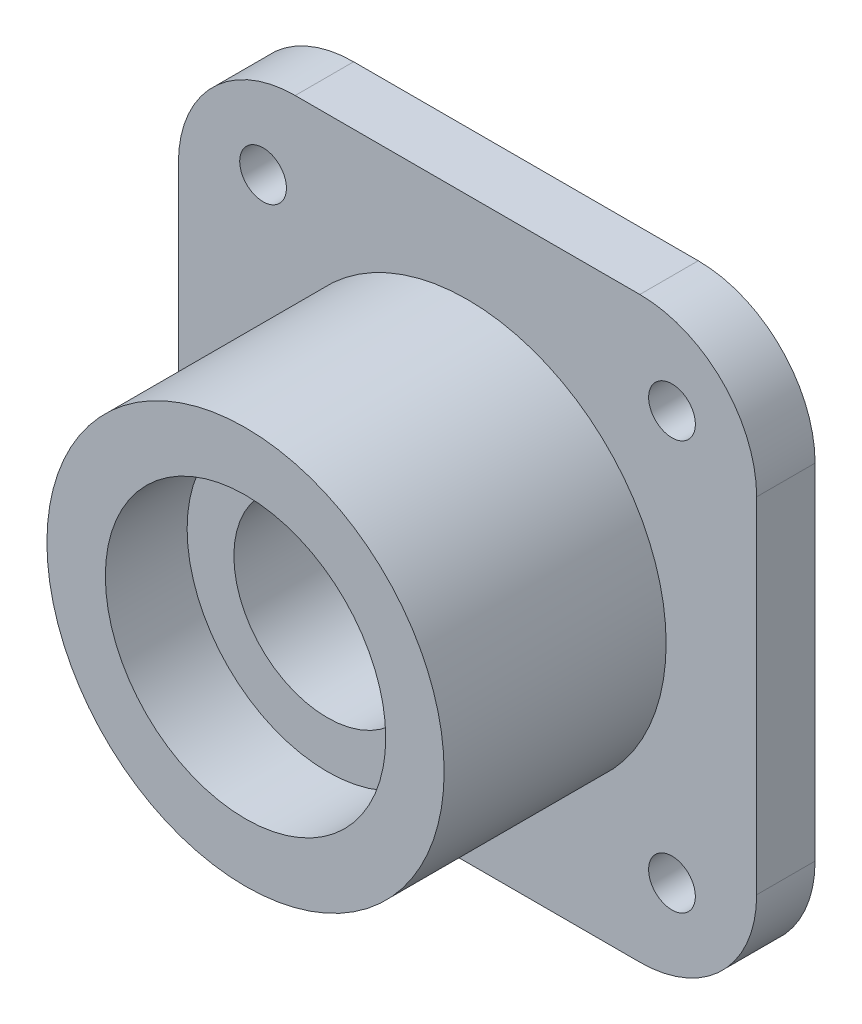
ISO-10303-21;
HEADER;
FILE_DESCRIPTION(('STEP AP214'),'2;1');
FILE_NAME('part.step','',(''),(''),'','','');
FILE_SCHEMA(('AUTOMOTIVE_DESIGN { 1 0 10303 214 1 1 1 1 }'));
ENDSEC;
DATA;
#1=APPLICATION_CONTEXT('core data for automotive mechanical design processes');
#2=APPLICATION_PROTOCOL_DEFINITION('international standard','automotive_design',2000,#1);
#3=PRODUCT_CONTEXT('',#1,'mechanical');
#4=PRODUCT('Part','Part','',(#3));
#5=PRODUCT_RELATED_PRODUCT_CATEGORY('part','',(#4));
#6=PRODUCT_DEFINITION_FORMATION('','',#4);
#7=PRODUCT_DEFINITION_CONTEXT('part definition',#1,'design');
#8=PRODUCT_DEFINITION('design','',#6,#7);
#9=PRODUCT_DEFINITION_SHAPE('','',#8);
#10=(LENGTH_UNIT() NAMED_UNIT(*) SI_UNIT(.MILLI.,.METRE.));
#11=(NAMED_UNIT(*) PLANE_ANGLE_UNIT() SI_UNIT($,.RADIAN.));
#12=(NAMED_UNIT(*) SI_UNIT($,.STERADIAN.) SOLID_ANGLE_UNIT());
#13=UNCERTAINTY_MEASURE_WITH_UNIT(LENGTH_MEASURE(1.E-05),#10,'distance_accuracy_value','');
#14=(GEOMETRIC_REPRESENTATION_CONTEXT(3) GLOBAL_UNCERTAINTY_ASSIGNED_CONTEXT((#13)) GLOBAL_UNIT_ASSIGNED_CONTEXT((#10,
#11,#12)) REPRESENTATION_CONTEXT('',''));
#15=CARTESIAN_POINT('',(0.,0.,0.));
#16=DIRECTION('',(0.,0.,1.));
#17=DIRECTION('',(1.,0.,0.));
#18=AXIS2_PLACEMENT_3D('',#15,#16,#17);
#19=CARTESIAN_POINT('',(0.,12.,-24.));
#20=DIRECTION('',(0.,0.,1.));
#21=DIRECTION('',(1.,0.,0.));
#22=AXIS2_PLACEMENT_3D('',#19,#20,#21);
#23=PLANE('',#22);
#24=CARTESIAN_POINT('',(17.5,-17.5,-24.));
#25=DIRECTION('',(0.,0.,-1.));
#26=DIRECTION('',(-1.,0.,0.));
#27=AXIS2_PLACEMENT_3D('',#24,#25,#26);
#28=CIRCLE('',#27,2.);
#29=CARTESIAN_POINT('',(15.5,-17.5,-24.));
#30=VERTEX_POINT('',#29);
#31=EDGE_CURVE('E317',#30,#30,#28,.T.);
#32=ORIENTED_EDGE('',*,*,#31,.F.);
#33=EDGE_LOOP('',(#32));
#34=FACE_BOUND('',#33,.T.);
#35=CARTESIAN_POINT('',(-17.5,-17.5,-24.));
#36=DIRECTION('',(0.,0.,-1.));
#37=DIRECTION('',(-1.,0.,0.));
#38=AXIS2_PLACEMENT_3D('',#35,#36,#37);
#39=CIRCLE('',#38,2.);
#40=CARTESIAN_POINT('',(-19.5,-17.5,-24.));
#41=VERTEX_POINT('',#40);
#42=EDGE_CURVE('E313',#41,#41,#39,.T.);
#43=ORIENTED_EDGE('',*,*,#42,.F.);
#44=EDGE_LOOP('',(#43));
#45=FACE_BOUND('',#44,.T.);
#46=CARTESIAN_POINT('',(-17.5,17.5,-24.));
#47=DIRECTION('',(0.,0.,-1.));
#48=DIRECTION('',(-1.,0.,0.));
#49=AXIS2_PLACEMENT_3D('',#46,#47,#48);
#50=CIRCLE('',#49,2.);
#51=CARTESIAN_POINT('',(-19.5,17.5,-24.));
#52=VERTEX_POINT('',#51);
#53=EDGE_CURVE('E306',#52,#52,#50,.T.);
#54=ORIENTED_EDGE('',*,*,#53,.F.);
#55=EDGE_LOOP('',(#54));
#56=FACE_BOUND('',#55,.T.);
#57=CARTESIAN_POINT('',(17.5,17.5,-24.));
#58=DIRECTION('',(0.,0.,-1.));
#59=DIRECTION('',(-1.,0.,0.));
#60=AXIS2_PLACEMENT_3D('',#57,#58,#59);
#61=CIRCLE('',#60,2.);
#62=CARTESIAN_POINT('',(15.5,17.5,-24.));
#63=VERTEX_POINT('',#62);
#64=EDGE_CURVE('E187',#63,#63,#61,.T.);
#65=ORIENTED_EDGE('',*,*,#64,.F.);
#66=EDGE_LOOP('',(#65));
#67=FACE_BOUND('',#66,.T.);
#68=CARTESIAN_POINT('',(0.,0.,-24.));
#69=DIRECTION('',(0.,0.,1.));
#70=DIRECTION('',(1.,0.,0.));
#71=AXIS2_PLACEMENT_3D('',#68,#69,#70);
#72=CIRCLE('',#71,12.);
#73=CARTESIAN_POINT('',(12.,0.,-24.));
#74=VERTEX_POINT('',#73);
#75=EDGE_CURVE('E144',#74,#74,#72,.T.);
#76=ORIENTED_EDGE('',*,*,#75,.T.);
#77=EDGE_LOOP('',(#76));
#78=FACE_BOUND('',#77,.T.);
#79=DIRECTION('',(1.,0.,0.));
#80=VECTOR('',#79,1.);
#81=CARTESIAN_POINT('',(0.,24.7487373415292,-24.));
#82=LINE('',#81,#80);
#83=CARTESIAN_POINT('',(-14.7487373415292,24.7487373415292,-24.));
#84=VERTEX_POINT('',#83);
#85=CARTESIAN_POINT('',(14.7487373415292,24.7487373415292,-24.));
#86=VERTEX_POINT('',#85);
#87=EDGE_CURVE('E132',#84,#86,#82,.T.);
#88=ORIENTED_EDGE('',*,*,#87,.T.);
#89=CARTESIAN_POINT('',(14.7487373415292,14.7487373415292,-24.));
#90=DIRECTION('',(0.,0.,1.));
#91=DIRECTION('',(1.,0.,0.));
#92=AXIS2_PLACEMENT_3D('',#89,#90,#91);
#93=CIRCLE('',#92,10.);
#94=CARTESIAN_POINT('',(24.7487373415292,14.7487373415292,-24.));
#95=VERTEX_POINT('',#94);
#96=EDGE_CURVE('E175',#86,#95,#93,.F.);
#97=ORIENTED_EDGE('',*,*,#96,.T.);
#98=DIRECTION('',(0.,-1.,0.));
#99=VECTOR('',#98,1.);
#100=CARTESIAN_POINT('',(24.7487373415292,12.,-24.));
#101=LINE('',#100,#99);
#102=CARTESIAN_POINT('',(24.7487373415292,-14.7487373415292,-24.));
#103=VERTEX_POINT('',#102);
#104=EDGE_CURVE('E121',#95,#103,#101,.T.);
#105=ORIENTED_EDGE('',*,*,#104,.T.);
#106=CARTESIAN_POINT('',(14.7487373415292,-14.7487373415292,-24.));
#107=DIRECTION('',(0.,0.,1.));
#108=DIRECTION('',(1.,0.,0.));
#109=AXIS2_PLACEMENT_3D('',#106,#107,#108);
#110=CIRCLE('',#109,10.);
#111=CARTESIAN_POINT('',(14.7487373415292,-24.7487373415292,-24.));
#112=VERTEX_POINT('',#111);
#113=EDGE_CURVE('E173',#103,#112,#110,.F.);
#114=ORIENTED_EDGE('',*,*,#113,.T.);
#115=DIRECTION('',(1.,0.,0.));
#116=VECTOR('',#115,1.);
#117=CARTESIAN_POINT('',(0.,-24.7487373415292,-24.));
#118=LINE('',#117,#116);
#119=CARTESIAN_POINT('',(-14.7487373415292,-24.7487373415292,-24.));
#120=VERTEX_POINT('',#119);
#121=EDGE_CURVE('E197',#120,#112,#118,.T.);
#122=ORIENTED_EDGE('',*,*,#121,.F.);
#123=CARTESIAN_POINT('',(-14.7487373415292,-14.7487373415292,-24.));
#124=DIRECTION('',(0.,0.,1.));
#125=DIRECTION('',(1.,0.,0.));
#126=AXIS2_PLACEMENT_3D('',#123,#124,#125);
#127=CIRCLE('',#126,10.);
#128=CARTESIAN_POINT('',(-24.7487373415292,-14.7487373415292,-24.));
#129=VERTEX_POINT('',#128);
#130=EDGE_CURVE('E50',#120,#129,#127,.F.);
#131=ORIENTED_EDGE('',*,*,#130,.T.);
#132=DIRECTION('',(0.,-1.,0.));
#133=VECTOR('',#132,1.);
#134=CARTESIAN_POINT('',(-24.7487373415292,12.,-24.));
#135=LINE('',#134,#133);
#136=CARTESIAN_POINT('',(-24.7487373415292,14.7487373415292,-24.));
#137=VERTEX_POINT('',#136);
#138=EDGE_CURVE('E127',#137,#129,#135,.T.);
#139=ORIENTED_EDGE('',*,*,#138,.F.);
#140=CARTESIAN_POINT('',(-14.7487373415292,14.7487373415292,-24.));
#141=DIRECTION('',(0.,0.,1.));
#142=DIRECTION('',(1.,0.,0.));
#143=AXIS2_PLACEMENT_3D('',#140,#141,#142);
#144=CIRCLE('',#143,10.);
#145=EDGE_CURVE('E170',#137,#84,#144,.F.);
#146=ORIENTED_EDGE('',*,*,#145,.T.);
#147=EDGE_LOOP('',(#88,#97,#105,#114,#122,#131,#139,#146));
#148=FACE_BOUND('',#147,.T.);
#149=ADVANCED_FACE('F33',(#34,#45,#56,#67,#78,#148),#23,.F.);
#150=CARTESIAN_POINT('',(0.,35.,-19.));
#151=DIRECTION('',(0.,0.,-1.));
#152=DIRECTION('',(-1.,0.,0.));
#153=AXIS2_PLACEMENT_3D('',#150,#151,#152);
#154=PLANE('',#153);
#155=CARTESIAN_POINT('',(17.5,-17.5,-19.));
#156=DIRECTION('',(0.,0.,-1.));
#157=DIRECTION('',(-1.,0.,0.));
#158=AXIS2_PLACEMENT_3D('',#155,#156,#157);
#159=CIRCLE('',#158,2.);
#160=CARTESIAN_POINT('',(15.5,-17.5,-19.));
#161=VERTEX_POINT('',#160);
#162=EDGE_CURVE('E37',#161,#161,#159,.T.);
#163=ORIENTED_EDGE('',*,*,#162,.T.);
#164=EDGE_LOOP('',(#163));
#165=FACE_BOUND('',#164,.T.);
#166=CARTESIAN_POINT('',(-17.5,-17.5,-19.));
#167=DIRECTION('',(0.,0.,-1.));
#168=DIRECTION('',(-1.,0.,0.));
#169=AXIS2_PLACEMENT_3D('',#166,#167,#168);
#170=CIRCLE('',#169,2.);
#171=CARTESIAN_POINT('',(-19.5,-17.5,-19.));
#172=VERTEX_POINT('',#171);
#173=EDGE_CURVE('E189',#172,#172,#170,.T.);
#174=ORIENTED_EDGE('',*,*,#173,.T.);
#175=EDGE_LOOP('',(#174));
#176=FACE_BOUND('',#175,.T.);
#177=CARTESIAN_POINT('',(-17.5,17.5,-19.));
#178=DIRECTION('',(0.,0.,-1.));
#179=DIRECTION('',(-1.,0.,0.));
#180=AXIS2_PLACEMENT_3D('',#177,#178,#179);
#181=CIRCLE('',#180,2.);
#182=CARTESIAN_POINT('',(-19.5,17.5,-19.));
#183=VERTEX_POINT('',#182);
#184=EDGE_CURVE('E186',#183,#183,#181,.T.);
#185=ORIENTED_EDGE('',*,*,#184,.T.);
#186=EDGE_LOOP('',(#185));
#187=FACE_BOUND('',#186,.T.);
#188=CARTESIAN_POINT('',(17.5,17.5,-19.));
#189=DIRECTION('',(0.,0.,-1.));
#190=DIRECTION('',(-1.,0.,0.));
#191=AXIS2_PLACEMENT_3D('',#188,#189,#190);
#192=CIRCLE('',#191,2.);
#193=CARTESIAN_POINT('',(15.5,17.5,-19.));
#194=VERTEX_POINT('',#193);
#195=EDGE_CURVE('E183',#194,#194,#192,.T.);
#196=ORIENTED_EDGE('',*,*,#195,.T.);
#197=EDGE_LOOP('',(#196));
#198=FACE_BOUND('',#197,.T.);
#199=CARTESIAN_POINT('',(0.,0.,-19.));
#200=DIRECTION('',(0.,0.,1.));
#201=DIRECTION('',(1.,0.,0.));
#202=AXIS2_PLACEMENT_3D('',#199,#200,#201);
#203=CIRCLE('',#202,17.);
#204=CARTESIAN_POINT('',(17.,0.,-19.));
#205=VERTEX_POINT('',#204);
#206=EDGE_CURVE('E141',#205,#205,#203,.T.);
#207=ORIENTED_EDGE('',*,*,#206,.F.);
#208=EDGE_LOOP('',(#207));
#209=FACE_BOUND('',#208,.T.);
#210=DIRECTION('',(0.,-1.,0.));
#211=VECTOR('',#210,1.);
#212=CARTESIAN_POINT('',(24.7487373415292,0.,-19.));
#213=LINE('',#212,#211);
#214=CARTESIAN_POINT('',(24.7487373415292,14.7487373415292,-19.));
#215=VERTEX_POINT('',#214);
#216=CARTESIAN_POINT('',(24.7487373415292,-14.7487373415292,-19.));
#217=VERTEX_POINT('',#216);
#218=EDGE_CURVE('E118',#215,#217,#213,.T.);
#219=ORIENTED_EDGE('',*,*,#218,.F.);
#220=CARTESIAN_POINT('',(14.7487373415292,14.7487373415292,-19.));
#221=DIRECTION('',(0.,0.,-1.));
#222=DIRECTION('',(-1.,0.,0.));
#223=AXIS2_PLACEMENT_3D('',#220,#221,#222);
#224=CIRCLE('',#223,10.);
#225=CARTESIAN_POINT('',(14.7487373415292,24.7487373415292,-19.));
#226=VERTEX_POINT('',#225);
#227=EDGE_CURVE('E101',#215,#226,#224,.F.);
#228=ORIENTED_EDGE('',*,*,#227,.T.);
#229=DIRECTION('',(1.,0.,0.));
#230=VECTOR('',#229,1.);
#231=CARTESIAN_POINT('',(0.,24.7487373415292,-19.));
#232=LINE('',#231,#230);
#233=CARTESIAN_POINT('',(-14.7487373415292,24.7487373415292,-19.));
#234=VERTEX_POINT('',#233);
#235=EDGE_CURVE('E201',#234,#226,#232,.T.);
#236=ORIENTED_EDGE('',*,*,#235,.F.);
#237=CARTESIAN_POINT('',(-14.7487373415292,14.7487373415292,-19.));
#238=DIRECTION('',(0.,0.,-1.));
#239=DIRECTION('',(-1.,0.,0.));
#240=AXIS2_PLACEMENT_3D('',#237,#238,#239);
#241=CIRCLE('',#240,10.);
#242=CARTESIAN_POINT('',(-24.7487373415292,14.7487373415292,-19.));
#243=VERTEX_POINT('',#242);
#244=EDGE_CURVE('E122',#234,#243,#241,.F.);
#245=ORIENTED_EDGE('',*,*,#244,.T.);
#246=DIRECTION('',(0.,-1.,0.));
#247=VECTOR('',#246,1.);
#248=CARTESIAN_POINT('',(-24.7487373415292,0.,-19.));
#249=LINE('',#248,#247);
#250=CARTESIAN_POINT('',(-24.7487373415292,-14.7487373415292,-19.));
#251=VERTEX_POINT('',#250);
#252=EDGE_CURVE('E128',#243,#251,#249,.T.);
#253=ORIENTED_EDGE('',*,*,#252,.T.);
#254=CARTESIAN_POINT('',(-14.7487373415292,-14.7487373415292,-19.));
#255=DIRECTION('',(0.,0.,-1.));
#256=DIRECTION('',(-1.,0.,0.));
#257=AXIS2_PLACEMENT_3D('',#254,#255,#256);
#258=CIRCLE('',#257,10.);
#259=CARTESIAN_POINT('',(-14.7487373415292,-24.7487373415292,-19.));
#260=VERTEX_POINT('',#259);
#261=EDGE_CURVE('E164',#251,#260,#258,.F.);
#262=ORIENTED_EDGE('',*,*,#261,.T.);
#263=DIRECTION('',(1.,0.,0.));
#264=VECTOR('',#263,1.);
#265=CARTESIAN_POINT('',(0.,-24.7487373415292,-19.));
#266=LINE('',#265,#264);
#267=CARTESIAN_POINT('',(14.7487373415292,-24.7487373415292,-19.));
#268=VERTEX_POINT('',#267);
#269=EDGE_CURVE('E194',#260,#268,#266,.T.);
#270=ORIENTED_EDGE('',*,*,#269,.T.);
#271=CARTESIAN_POINT('',(14.7487373415292,-14.7487373415292,-19.));
#272=DIRECTION('',(0.,0.,-1.));
#273=DIRECTION('',(-1.,0.,0.));
#274=AXIS2_PLACEMENT_3D('',#271,#272,#273);
#275=CIRCLE('',#274,10.);
#276=EDGE_CURVE('E112',#268,#217,#275,.F.);
#277=ORIENTED_EDGE('',*,*,#276,.T.);
#278=EDGE_LOOP('',(#219,#228,#236,#245,#253,#262,#270,#277));
#279=FACE_BOUND('',#278,.T.);
#280=ADVANCED_FACE('F125',(#165,#176,#187,#198,#209,#279),#154,.F.);
#281=CARTESIAN_POINT('',(0.,17.,0.));
#282=DIRECTION('',(0.,0.,-1.));
#283=DIRECTION('',(-1.,0.,0.));
#284=AXIS2_PLACEMENT_3D('',#281,#282,#283);
#285=PLANE('',#284);
#286=CARTESIAN_POINT('',(0.,0.,0.));
#287=DIRECTION('',(0.,0.,1.));
#288=DIRECTION('',(1.,0.,0.));
#289=AXIS2_PLACEMENT_3D('',#286,#287,#288);
#290=CIRCLE('',#289,12.);
#291=CARTESIAN_POINT('',(12.,0.,0.));
#292=VERTEX_POINT('',#291);
#293=EDGE_CURVE('E159',#292,#292,#290,.T.);
#294=ORIENTED_EDGE('',*,*,#293,.F.);
#295=EDGE_LOOP('',(#294));
#296=FACE_BOUND('',#295,.T.);
#297=CARTESIAN_POINT('',(0.,0.,0.));
#298=DIRECTION('',(0.,0.,1.));
#299=DIRECTION('',(1.,0.,0.));
#300=AXIS2_PLACEMENT_3D('',#297,#298,#299);
#301=CIRCLE('',#300,17.);
#302=CARTESIAN_POINT('',(17.,0.,0.));
#303=VERTEX_POINT('',#302);
#304=EDGE_CURVE('E138',#303,#303,#301,.T.);
#305=ORIENTED_EDGE('',*,*,#304,.T.);
#306=EDGE_LOOP('',(#305));
#307=FACE_BOUND('',#306,.T.);
#308=ADVANCED_FACE('F236',(#296,#307),#285,.F.);
#309=CARTESIAN_POINT('',(0.,0.,0.));
#310=DIRECTION('',(0.,0.,1.));
#311=DIRECTION('',(1.,0.,0.));
#312=AXIS2_PLACEMENT_3D('',#309,#310,#311);
#313=CYLINDRICAL_SURFACE('',#312,12.);
#314=CARTESIAN_POINT('',(0.,0.,-7.));
#315=DIRECTION('',(0.,0.,1.));
#316=DIRECTION('',(1.,0.,0.));
#317=AXIS2_PLACEMENT_3D('',#314,#315,#316);
#318=CIRCLE('',#317,12.);
#319=CARTESIAN_POINT('',(12.,0.,-7.));
#320=VERTEX_POINT('',#319);
#321=EDGE_CURVE('E156',#320,#320,#318,.T.);
#322=ORIENTED_EDGE('',*,*,#321,.F.);
#323=EDGE_LOOP('',(#322));
#324=FACE_BOUND('',#323,.T.);
#325=ORIENTED_EDGE('',*,*,#293,.T.);
#326=EDGE_LOOP('',(#325));
#327=FACE_BOUND('',#326,.T.);
#328=ADVANCED_FACE('F258',(#324,#327),#313,.F.);
#329=CARTESIAN_POINT('',(0.,12.,-7.));
#330=DIRECTION('',(0.,0.,-1.));
#331=DIRECTION('',(-1.,0.,0.));
#332=AXIS2_PLACEMENT_3D('',#329,#330,#331);
#333=PLANE('',#332);
#334=CARTESIAN_POINT('',(0.,0.,-7.));
#335=DIRECTION('',(0.,0.,1.));
#336=DIRECTION('',(1.,0.,0.));
#337=AXIS2_PLACEMENT_3D('',#334,#335,#336);
#338=CIRCLE('',#337,8.);
#339=CARTESIAN_POINT('',(8.,0.,-7.));
#340=VERTEX_POINT('',#339);
#341=EDGE_CURVE('E153',#340,#340,#338,.T.);
#342=ORIENTED_EDGE('',*,*,#341,.F.);
#343=EDGE_LOOP('',(#342));
#344=FACE_BOUND('',#343,.T.);
#345=ORIENTED_EDGE('',*,*,#321,.T.);
#346=EDGE_LOOP('',(#345));
#347=FACE_BOUND('',#346,.T.);
#348=ADVANCED_FACE('F254',(#344,#347),#333,.F.);
#349=CARTESIAN_POINT('',(0.,0.,0.));
#350=DIRECTION('',(0.,0.,1.));
#351=DIRECTION('',(1.,0.,0.));
#352=AXIS2_PLACEMENT_3D('',#349,#350,#351);
#353=CYLINDRICAL_SURFACE('',#352,8.);
#354=CARTESIAN_POINT('',(0.,0.,-17.));
#355=DIRECTION('',(0.,0.,1.));
#356=DIRECTION('',(1.,0.,0.));
#357=AXIS2_PLACEMENT_3D('',#354,#355,#356);
#358=CIRCLE('',#357,8.);
#359=CARTESIAN_POINT('',(8.,0.,-17.));
#360=VERTEX_POINT('',#359);
#361=EDGE_CURVE('E150',#360,#360,#358,.T.);
#362=ORIENTED_EDGE('',*,*,#361,.F.);
#363=EDGE_LOOP('',(#362));
#364=FACE_BOUND('',#363,.T.);
#365=ORIENTED_EDGE('',*,*,#341,.T.);
#366=EDGE_LOOP('',(#365));
#367=FACE_BOUND('',#366,.T.);
#368=ADVANCED_FACE('F250',(#364,#367),#353,.F.);
#369=CARTESIAN_POINT('',(0.,8.,-17.));
#370=DIRECTION('',(0.,0.,1.));
#371=DIRECTION('',(1.,0.,0.));
#372=AXIS2_PLACEMENT_3D('',#369,#370,#371);
#373=PLANE('',#372);
#374=CARTESIAN_POINT('',(0.,0.,-17.));
#375=DIRECTION('',(0.,0.,1.));
#376=DIRECTION('',(1.,0.,0.));
#377=AXIS2_PLACEMENT_3D('',#374,#375,#376);
#378=CIRCLE('',#377,12.);
#379=CARTESIAN_POINT('',(12.,0.,-17.));
#380=VERTEX_POINT('',#379);
#381=EDGE_CURVE('E147',#380,#380,#378,.T.);
#382=ORIENTED_EDGE('',*,*,#381,.F.);
#383=EDGE_LOOP('',(#382));
#384=FACE_BOUND('',#383,.T.);
#385=ORIENTED_EDGE('',*,*,#361,.T.);
#386=EDGE_LOOP('',(#385));
#387=FACE_BOUND('',#386,.T.);
#388=ADVANCED_FACE('F246',(#384,#387),#373,.F.);
#389=CARTESIAN_POINT('',(0.,0.,0.));
#390=DIRECTION('',(0.,0.,1.));
#391=DIRECTION('',(1.,0.,0.));
#392=AXIS2_PLACEMENT_3D('',#389,#390,#391);
#393=CYLINDRICAL_SURFACE('',#392,12.);
#394=ORIENTED_EDGE('',*,*,#75,.F.);
#395=EDGE_LOOP('',(#394));
#396=FACE_BOUND('',#395,.T.);
#397=ORIENTED_EDGE('',*,*,#381,.T.);
#398=EDGE_LOOP('',(#397));
#399=FACE_BOUND('',#398,.T.);
#400=ADVANCED_FACE('F242',(#396,#399),#393,.F.);
#401=CARTESIAN_POINT('',(0.,0.,0.));
#402=DIRECTION('',(0.,0.,1.));
#403=DIRECTION('',(1.,0.,0.));
#404=AXIS2_PLACEMENT_3D('',#401,#402,#403);
#405=CYLINDRICAL_SURFACE('',#404,17.);
#406=ORIENTED_EDGE('',*,*,#304,.F.);
#407=EDGE_LOOP('',(#406));
#408=FACE_BOUND('',#407,.T.);
#409=ORIENTED_EDGE('',*,*,#206,.T.);
#410=EDGE_LOOP('',(#409));
#411=FACE_BOUND('',#410,.T.);
#412=ADVANCED_FACE('F245',(#408,#411),#405,.T.);
#413=CARTESIAN_POINT('',(-24.7487373415292,0.,-29.));
#414=DIRECTION('',(-1.,0.,0.));
#415=DIRECTION('',(0.,0.,1.));
#416=AXIS2_PLACEMENT_3D('',#413,#414,#415);
#417=PLANE('',#416);
#418=ORIENTED_EDGE('',*,*,#138,.T.);
#419=DIRECTION('',(0.,0.,1.));
#420=VECTOR('',#419,1.);
#421=CARTESIAN_POINT('',(-24.7487373415292,-14.7487373415292,-29.));
#422=LINE('',#421,#420);
#423=EDGE_CURVE('E11',#129,#251,#422,.T.);
#424=ORIENTED_EDGE('',*,*,#423,.T.);
#425=ORIENTED_EDGE('',*,*,#252,.F.);
#426=DIRECTION('',(0.,0.,1.));
#427=VECTOR('',#426,1.);
#428=CARTESIAN_POINT('',(-24.7487373415292,14.7487373415292,-24.));
#429=LINE('',#428,#427);
#430=EDGE_CURVE('E42',#243,#137,#429,.F.);
#431=ORIENTED_EDGE('',*,*,#430,.T.);
#432=EDGE_LOOP('',(#418,#424,#425,#431));
#433=FACE_BOUND('',#432,.T.);
#434=ADVANCED_FACE('F212',(#433),#417,.T.);
#435=CARTESIAN_POINT('',(24.7487373415292,0.,-29.));
#436=DIRECTION('',(-1.,0.,0.));
#437=DIRECTION('',(0.,0.,1.));
#438=AXIS2_PLACEMENT_3D('',#435,#436,#437);
#439=PLANE('',#438);
#440=ORIENTED_EDGE('',*,*,#104,.F.);
#441=DIRECTION('',(0.,0.,1.));
#442=VECTOR('',#441,1.);
#443=CARTESIAN_POINT('',(24.7487373415292,14.7487373415292,-29.));
#444=LINE('',#443,#442);
#445=EDGE_CURVE('E105',#95,#215,#444,.T.);
#446=ORIENTED_EDGE('',*,*,#445,.T.);
#447=ORIENTED_EDGE('',*,*,#218,.T.);
#448=DIRECTION('',(0.,0.,1.));
#449=VECTOR('',#448,1.);
#450=CARTESIAN_POINT('',(24.7487373415292,-14.7487373415292,-24.));
#451=LINE('',#450,#449);
#452=EDGE_CURVE('E123',#217,#103,#451,.F.);
#453=ORIENTED_EDGE('',*,*,#452,.T.);
#454=EDGE_LOOP('',(#440,#446,#447,#453));
#455=FACE_BOUND('',#454,.T.);
#456=ADVANCED_FACE('F117',(#455),#439,.F.);
#457=CARTESIAN_POINT('',(0.,24.7487373415292,-29.));
#458=DIRECTION('',(0.,-1.,0.));
#459=DIRECTION('',(0.,0.,-1.));
#460=AXIS2_PLACEMENT_3D('',#457,#458,#459);
#461=PLANE('',#460);
#462=ORIENTED_EDGE('',*,*,#235,.T.);
#463=DIRECTION('',(0.,0.,1.));
#464=VECTOR('',#463,1.);
#465=CARTESIAN_POINT('',(14.7487373415292,24.7487373415292,-29.));
#466=LINE('',#465,#464);
#467=EDGE_CURVE('E106',#226,#86,#466,.F.);
#468=ORIENTED_EDGE('',*,*,#467,.T.);
#469=ORIENTED_EDGE('',*,*,#87,.F.);
#470=DIRECTION('',(0.,0.,1.));
#471=VECTOR('',#470,1.);
#472=CARTESIAN_POINT('',(-14.7487373415292,24.7487373415292,-19.));
#473=LINE('',#472,#471);
#474=EDGE_CURVE('E111',#84,#234,#473,.T.);
#475=ORIENTED_EDGE('',*,*,#474,.T.);
#476=EDGE_LOOP('',(#462,#468,#469,#475));
#477=FACE_BOUND('',#476,.T.);
#478=ADVANCED_FACE('F210',(#477),#461,.F.);
#479=CARTESIAN_POINT('',(0.,-24.7487373415292,-29.));
#480=DIRECTION('',(0.,-1.,0.));
#481=DIRECTION('',(1.,0.,0.));
#482=AXIS2_PLACEMENT_3D('',#479,#480,#481);
#483=PLANE('',#482);
#484=ORIENTED_EDGE('',*,*,#121,.T.);
#485=DIRECTION('',(0.,0.,1.));
#486=VECTOR('',#485,1.);
#487=CARTESIAN_POINT('',(14.7487373415292,-24.7487373415292,-19.));
#488=LINE('',#487,#486);
#489=EDGE_CURVE('E179',#112,#268,#488,.T.);
#490=ORIENTED_EDGE('',*,*,#489,.T.);
#491=ORIENTED_EDGE('',*,*,#269,.F.);
#492=DIRECTION('',(0.,0.,1.));
#493=VECTOR('',#492,1.);
#494=CARTESIAN_POINT('',(-14.7487373415292,-24.7487373415292,-29.));
#495=LINE('',#494,#493);
#496=EDGE_CURVE('E177',#260,#120,#495,.F.);
#497=ORIENTED_EDGE('',*,*,#496,.T.);
#498=EDGE_LOOP('',(#484,#490,#491,#497));
#499=FACE_BOUND('',#498,.T.);
#500=ADVANCED_FACE('F218',(#499),#483,.T.);
#501=CARTESIAN_POINT('',(14.7487373415292,14.7487373415292,-29.));
#502=DIRECTION('',(0.,0.,1.));
#503=DIRECTION('',(1.,0.,0.));
#504=AXIS2_PLACEMENT_3D('',#501,#502,#503);
#505=CYLINDRICAL_SURFACE('',#504,10.);
#506=ORIENTED_EDGE('',*,*,#96,.F.);
#507=ORIENTED_EDGE('',*,*,#467,.F.);
#508=ORIENTED_EDGE('',*,*,#227,.F.);
#509=ORIENTED_EDGE('',*,*,#445,.F.);
#510=EDGE_LOOP('',(#506,#507,#508,#509));
#511=FACE_BOUND('',#510,.T.);
#512=ADVANCED_FACE('F104',(#511),#505,.T.);
#513=CARTESIAN_POINT('',(14.7487373415292,-14.7487373415292,-29.));
#514=DIRECTION('',(0.,0.,-1.));
#515=DIRECTION('',(-1.,0.,0.));
#516=AXIS2_PLACEMENT_3D('',#513,#514,#515);
#517=CYLINDRICAL_SURFACE('',#516,10.);
#518=ORIENTED_EDGE('',*,*,#113,.F.);
#519=ORIENTED_EDGE('',*,*,#452,.F.);
#520=ORIENTED_EDGE('',*,*,#276,.F.);
#521=ORIENTED_EDGE('',*,*,#489,.F.);
#522=EDGE_LOOP('',(#518,#519,#520,#521));
#523=FACE_BOUND('',#522,.T.);
#524=ADVANCED_FACE('F222',(#523),#517,.T.);
#525=CARTESIAN_POINT('',(-14.7487373415292,-14.7487373415292,-29.));
#526=DIRECTION('',(0.,0.,1.));
#527=DIRECTION('',(1.,0.,0.));
#528=AXIS2_PLACEMENT_3D('',#525,#526,#527);
#529=CYLINDRICAL_SURFACE('',#528,10.);
#530=ORIENTED_EDGE('',*,*,#130,.F.);
#531=ORIENTED_EDGE('',*,*,#496,.F.);
#532=ORIENTED_EDGE('',*,*,#261,.F.);
#533=ORIENTED_EDGE('',*,*,#423,.F.);
#534=EDGE_LOOP('',(#530,#531,#532,#533));
#535=FACE_BOUND('',#534,.T.);
#536=ADVANCED_FACE('F215',(#535),#529,.T.);
#537=CARTESIAN_POINT('',(-14.7487373415292,14.7487373415292,-29.));
#538=DIRECTION('',(0.,0.,-1.));
#539=DIRECTION('',(-1.,0.,0.));
#540=AXIS2_PLACEMENT_3D('',#537,#538,#539);
#541=CYLINDRICAL_SURFACE('',#540,10.);
#542=ORIENTED_EDGE('',*,*,#145,.F.);
#543=ORIENTED_EDGE('',*,*,#430,.F.);
#544=ORIENTED_EDGE('',*,*,#244,.F.);
#545=ORIENTED_EDGE('',*,*,#474,.F.);
#546=EDGE_LOOP('',(#542,#543,#544,#545));
#547=FACE_BOUND('',#546,.T.);
#548=ADVANCED_FACE('F35',(#547),#541,.T.);
#549=CARTESIAN_POINT('',(17.5,17.5,-14.));
#550=DIRECTION('',(0.,0.,-1.));
#551=DIRECTION('',(-1.,0.,0.));
#552=AXIS2_PLACEMENT_3D('',#549,#550,#551);
#553=CYLINDRICAL_SURFACE('',#552,2.);
#554=ORIENTED_EDGE('',*,*,#64,.T.);
#555=EDGE_LOOP('',(#554));
#556=FACE_BOUND('',#555,.T.);
#557=ORIENTED_EDGE('',*,*,#195,.F.);
#558=EDGE_LOOP('',(#557));
#559=FACE_BOUND('',#558,.T.);
#560=ADVANCED_FACE('F286',(#556,#559),#553,.F.);
#561=CARTESIAN_POINT('',(-17.5,17.5,-14.));
#562=DIRECTION('',(0.,0.,-1.));
#563=DIRECTION('',(-1.,0.,0.));
#564=AXIS2_PLACEMENT_3D('',#561,#562,#563);
#565=CYLINDRICAL_SURFACE('',#564,2.);
#566=ORIENTED_EDGE('',*,*,#53,.T.);
#567=EDGE_LOOP('',(#566));
#568=FACE_BOUND('',#567,.T.);
#569=ORIENTED_EDGE('',*,*,#184,.F.);
#570=EDGE_LOOP('',(#569));
#571=FACE_BOUND('',#570,.T.);
#572=ADVANCED_FACE('F289',(#568,#571),#565,.F.);
#573=CARTESIAN_POINT('',(-17.5,-17.5,-14.));
#574=DIRECTION('',(0.,0.,-1.));
#575=DIRECTION('',(-1.,0.,0.));
#576=AXIS2_PLACEMENT_3D('',#573,#574,#575);
#577=CYLINDRICAL_SURFACE('',#576,2.);
#578=ORIENTED_EDGE('',*,*,#42,.T.);
#579=EDGE_LOOP('',(#578));
#580=FACE_BOUND('',#579,.T.);
#581=ORIENTED_EDGE('',*,*,#173,.F.);
#582=EDGE_LOOP('',(#581));
#583=FACE_BOUND('',#582,.T.);
#584=ADVANCED_FACE('F294',(#580,#583),#577,.F.);
#585=CARTESIAN_POINT('',(17.5,-17.5,-14.));
#586=DIRECTION('',(0.,0.,-1.));
#587=DIRECTION('',(-1.,0.,0.));
#588=AXIS2_PLACEMENT_3D('',#585,#586,#587);
#589=CYLINDRICAL_SURFACE('',#588,2.);
#590=ORIENTED_EDGE('',*,*,#31,.T.);
#591=EDGE_LOOP('',(#590));
#592=FACE_BOUND('',#591,.T.);
#593=ORIENTED_EDGE('',*,*,#162,.F.);
#594=EDGE_LOOP('',(#593));
#595=FACE_BOUND('',#594,.T.);
#596=ADVANCED_FACE('F291',(#592,#595),#589,.F.);
#597=CLOSED_SHELL('',(#149,#280,#308,#328,#348,#368,#388,#400,#412,#434,#456,#478,#500,#512,
#524,#536,#548,#560,#572,#584,#596));
#598=MANIFOLD_SOLID_BREP('B2',#597);
#599=ADVANCED_BREP_SHAPE_REPRESENTATION('',(#18,#598),#14);
#600=SHAPE_DEFINITION_REPRESENTATION(#9,#599);
ENDSEC;
END-ISO-10303-21;
